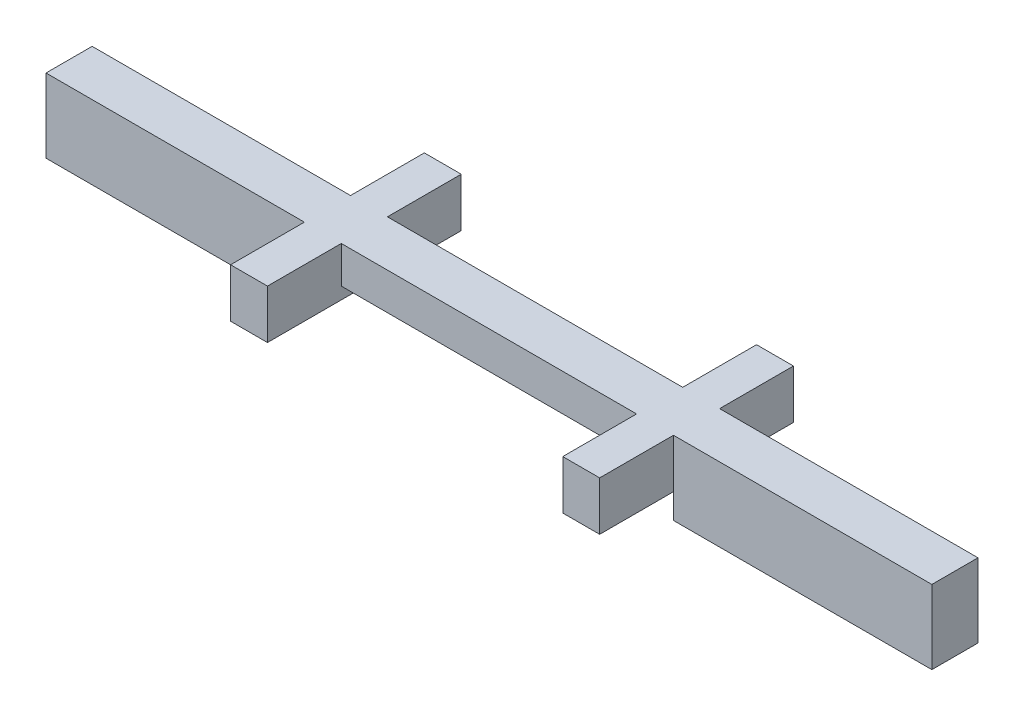
ISO-10303-21;
HEADER;
FILE_DESCRIPTION(('STEP AP214'),'2;1');
FILE_NAME('part.step','',(''),(''),'','','');
FILE_SCHEMA(('AUTOMOTIVE_DESIGN { 1 0 10303 214 1 1 1 1 }'));
ENDSEC;
DATA;
#1=APPLICATION_CONTEXT('core data for automotive mechanical design processes');
#2=APPLICATION_PROTOCOL_DEFINITION('international standard','automotive_design',2000,#1);
#3=PRODUCT_CONTEXT('',#1,'mechanical');
#4=PRODUCT('Part','Part','',(#3));
#5=PRODUCT_RELATED_PRODUCT_CATEGORY('part','',(#4));
#6=PRODUCT_DEFINITION_FORMATION('','',#4);
#7=PRODUCT_DEFINITION_CONTEXT('part definition',#1,'design');
#8=PRODUCT_DEFINITION('design','',#6,#7);
#9=PRODUCT_DEFINITION_SHAPE('','',#8);
#10=(LENGTH_UNIT() NAMED_UNIT(*) SI_UNIT(.MILLI.,.METRE.));
#11=(NAMED_UNIT(*) PLANE_ANGLE_UNIT() SI_UNIT($,.RADIAN.));
#12=(NAMED_UNIT(*) SI_UNIT($,.STERADIAN.) SOLID_ANGLE_UNIT());
#13=UNCERTAINTY_MEASURE_WITH_UNIT(LENGTH_MEASURE(1.E-05),#10,'distance_accuracy_value','');
#14=(GEOMETRIC_REPRESENTATION_CONTEXT(3) GLOBAL_UNCERTAINTY_ASSIGNED_CONTEXT((#13)) GLOBAL_UNIT_ASSIGNED_CONTEXT((#10,
#11,#12)) REPRESENTATION_CONTEXT('',''));
#15=CARTESIAN_POINT('',(0.,0.,0.));
#16=DIRECTION('',(0.,0.,1.));
#17=DIRECTION('',(1.,0.,0.));
#18=AXIS2_PLACEMENT_3D('',#15,#16,#17);
#19=CARTESIAN_POINT('',(0.,0.,1.25));
#20=DIRECTION('',(0.,0.,-1.));
#21=DIRECTION('',(-1.,0.,0.));
#22=AXIS2_PLACEMENT_3D('',#19,#20,#21);
#23=PLANE('',#22);
#24=DIRECTION('',(0.,-1.,0.));
#25=VECTOR('',#24,1.);
#26=CARTESIAN_POINT('',(9.,-0.325,1.25));
#27=LINE('',#26,#25);
#28=CARTESIAN_POINT('',(9.,1.,1.25));
#29=VERTEX_POINT('',#28);
#30=CARTESIAN_POINT('',(9.,0.,1.25));
#31=VERTEX_POINT('',#30);
#32=EDGE_CURVE('E57',#29,#31,#27,.T.);
#33=ORIENTED_EDGE('',*,*,#32,.F.);
#34=DIRECTION('',(-1.,0.,0.));
#35=VECTOR('',#34,1.);
#36=CARTESIAN_POINT('',(10.,1.,1.25));
#37=LINE('',#36,#35);
#38=CARTESIAN_POINT('',(0.999999999999999,1.,1.25));
#39=VERTEX_POINT('',#38);
#40=EDGE_CURVE('E338',#29,#39,#37,.T.);
#41=ORIENTED_EDGE('',*,*,#40,.T.);
#42=DIRECTION('',(0.,1.,0.));
#43=VECTOR('',#42,1.);
#44=CARTESIAN_POINT('',(1.,-0.325,1.25));
#45=LINE('',#44,#43);
#46=CARTESIAN_POINT('',(1.,0.,1.25));
#47=VERTEX_POINT('',#46);
#48=EDGE_CURVE('E11',#47,#39,#45,.T.);
#49=ORIENTED_EDGE('',*,*,#48,.F.);
#50=DIRECTION('',(1.,0.,0.));
#51=VECTOR('',#50,1.);
#52=CARTESIAN_POINT('',(1.,0.,1.25));
#53=LINE('',#52,#51);
#54=EDGE_CURVE('E349',#47,#31,#53,.T.);
#55=ORIENTED_EDGE('',*,*,#54,.T.);
#56=EDGE_LOOP('',(#33,#41,#49,#55));
#57=FACE_BOUND('',#56,.T.);
#58=ADVANCED_FACE('F39',(#57),#23,.F.);
#59=DIRECTION('',(0.,1.,0.));
#60=VECTOR('',#59,1.);
#61=CARTESIAN_POINT('',(10.,-0.325,1.25));
#62=LINE('',#61,#60);
#63=CARTESIAN_POINT('',(10.,-0.325,1.25));
#64=VERTEX_POINT('',#63);
#65=CARTESIAN_POINT('',(10.,1.,1.25));
#66=VERTEX_POINT('',#65);
#67=EDGE_CURVE('E225',#64,#66,#62,.T.);
#68=ORIENTED_EDGE('',*,*,#67,.F.);
#69=DIRECTION('',(0.,-1.,0.));
#70=VECTOR('',#69,1.);
#71=CARTESIAN_POINT('',(10.,-0.325,1.25));
#72=LINE('',#71,#70);
#73=CARTESIAN_POINT('',(10.,-1.,1.25));
#74=VERTEX_POINT('',#73);
#75=EDGE_CURVE('E352',#64,#74,#72,.T.);
#76=ORIENTED_EDGE('',*,*,#75,.T.);
#77=DIRECTION('',(1.,0.,0.));
#78=VECTOR('',#77,1.);
#79=CARTESIAN_POINT('',(10.,-1.,1.25));
#80=LINE('',#79,#78);
#81=CARTESIAN_POINT('',(17.,-1.,1.25));
#82=VERTEX_POINT('',#81);
#83=EDGE_CURVE('E355',#74,#82,#80,.T.);
#84=ORIENTED_EDGE('',*,*,#83,.T.);
#85=DIRECTION('',(0.,1.,0.));
#86=VECTOR('',#85,1.);
#87=CARTESIAN_POINT('',(17.,1.,1.25));
#88=LINE('',#87,#86);
#89=CARTESIAN_POINT('',(17.,1.,1.25));
#90=VERTEX_POINT('',#89);
#91=EDGE_CURVE('E358',#82,#90,#88,.T.);
#92=ORIENTED_EDGE('',*,*,#91,.T.);
#93=EDGE_CURVE('E65',#90,#66,#37,.T.);
#94=ORIENTED_EDGE('',*,*,#93,.T.);
#95=EDGE_LOOP('',(#68,#76,#84,#92,#94));
#96=FACE_BOUND('',#95,.T.);
#97=ADVANCED_FACE('F478',(#96),#23,.F.);
#98=DIRECTION('',(0.,-1.,0.));
#99=VECTOR('',#98,1.);
#100=CARTESIAN_POINT('',(0.,-0.325,1.25));
#101=LINE('',#100,#99);
#102=CARTESIAN_POINT('',(0.,1.,1.25));
#103=VERTEX_POINT('',#102);
#104=CARTESIAN_POINT('',(0.,-0.325,1.25));
#105=VERTEX_POINT('',#104);
#106=EDGE_CURVE('E245',#103,#105,#101,.T.);
#107=ORIENTED_EDGE('',*,*,#106,.F.);
#108=CARTESIAN_POINT('',(-7.,0.999999999999999,1.25));
#109=VERTEX_POINT('',#108);
#110=EDGE_CURVE('E339',#103,#109,#37,.T.);
#111=ORIENTED_EDGE('',*,*,#110,.T.);
#112=DIRECTION('',(0.,-1.,0.));
#113=VECTOR('',#112,1.);
#114=CARTESIAN_POINT('',(-7.,0.999999999999999,1.25));
#115=LINE('',#114,#113);
#116=CARTESIAN_POINT('',(-7.,-1.,1.25));
#117=VERTEX_POINT('',#116);
#118=EDGE_CURVE('E337',#109,#117,#115,.T.);
#119=ORIENTED_EDGE('',*,*,#118,.T.);
#120=DIRECTION('',(1.,0.,0.));
#121=VECTOR('',#120,1.);
#122=CARTESIAN_POINT('',(0.,-1.,1.25));
#123=LINE('',#122,#121);
#124=CARTESIAN_POINT('',(0.,-1.,1.25));
#125=VERTEX_POINT('',#124);
#126=EDGE_CURVE('E342',#117,#125,#123,.T.);
#127=ORIENTED_EDGE('',*,*,#126,.T.);
#128=DIRECTION('',(0.,1.,0.));
#129=VECTOR('',#128,1.);
#130=CARTESIAN_POINT('',(0.,-0.325,1.25));
#131=LINE('',#130,#129);
#132=EDGE_CURVE('E345',#125,#105,#131,.T.);
#133=ORIENTED_EDGE('',*,*,#132,.T.);
#134=EDGE_LOOP('',(#107,#111,#119,#127,#133));
#135=FACE_BOUND('',#134,.T.);
#136=ADVANCED_FACE('F448',(#135),#23,.F.);
#137=CARTESIAN_POINT('',(0.,0.,0.));
#138=DIRECTION('',(0.,0.,-1.));
#139=DIRECTION('',(-1.,0.,0.));
#140=AXIS2_PLACEMENT_3D('',#137,#138,#139);
#141=PLANE('',#140);
#142=DIRECTION('',(1.,0.,0.));
#143=VECTOR('',#142,1.);
#144=CARTESIAN_POINT('',(1.,0.,0.));
#145=LINE('',#144,#143);
#146=CARTESIAN_POINT('',(1.,0.,0.));
#147=VERTEX_POINT('',#146);
#148=CARTESIAN_POINT('',(9.,0.,0.));
#149=VERTEX_POINT('',#148);
#150=EDGE_CURVE('E377',#147,#149,#145,.T.);
#151=ORIENTED_EDGE('',*,*,#150,.F.);
#152=DIRECTION('',(0.,-1.,0.));
#153=VECTOR('',#152,1.);
#154=CARTESIAN_POINT('',(1.,-0.325,0.));
#155=LINE('',#154,#153);
#156=CARTESIAN_POINT('',(1.,0.999999999999999,0.));
#157=VERTEX_POINT('',#156);
#158=EDGE_CURVE('E275',#157,#147,#155,.T.);
#159=ORIENTED_EDGE('',*,*,#158,.F.);
#160=DIRECTION('',(-1.,0.,0.));
#161=VECTOR('',#160,1.);
#162=CARTESIAN_POINT('',(0.,1.,0.));
#163=LINE('',#162,#161);
#164=CARTESIAN_POINT('',(9.,1.,0.));
#165=VERTEX_POINT('',#164);
#166=EDGE_CURVE('E367',#165,#157,#163,.T.);
#167=ORIENTED_EDGE('',*,*,#166,.F.);
#168=DIRECTION('',(0.,1.,0.));
#169=VECTOR('',#168,1.);
#170=CARTESIAN_POINT('',(9.,-0.325,0.));
#171=LINE('',#170,#169);
#172=EDGE_CURVE('E49',#149,#165,#171,.T.);
#173=ORIENTED_EDGE('',*,*,#172,.F.);
#174=EDGE_LOOP('',(#151,#159,#167,#173));
#175=FACE_BOUND('',#174,.T.);
#176=ADVANCED_FACE('F503',(#175),#141,.T.);
#177=CARTESIAN_POINT('',(0.,0.999999999999999,0.));
#178=VERTEX_POINT('',#177);
#179=CARTESIAN_POINT('',(-7.,0.999999999999999,0.));
#180=VERTEX_POINT('',#179);
#181=EDGE_CURVE('E334',#178,#180,#163,.T.);
#182=ORIENTED_EDGE('',*,*,#181,.F.);
#183=DIRECTION('',(0.,1.,0.));
#184=VECTOR('',#183,1.);
#185=CARTESIAN_POINT('',(0.,-0.325,0.));
#186=LINE('',#185,#184);
#187=CARTESIAN_POINT('',(0.,-0.325,0.));
#188=VERTEX_POINT('',#187);
#189=EDGE_CURVE('E281',#188,#178,#186,.T.);
#190=ORIENTED_EDGE('',*,*,#189,.F.);
#191=DIRECTION('',(0.,1.,0.));
#192=VECTOR('',#191,1.);
#193=CARTESIAN_POINT('',(0.,-0.325,0.));
#194=LINE('',#193,#192);
#195=CARTESIAN_POINT('',(0.,-1.,0.));
#196=VERTEX_POINT('',#195);
#197=EDGE_CURVE('E373',#196,#188,#194,.T.);
#198=ORIENTED_EDGE('',*,*,#197,.F.);
#199=DIRECTION('',(1.,0.,0.));
#200=VECTOR('',#199,1.);
#201=CARTESIAN_POINT('',(0.,-1.,0.));
#202=LINE('',#201,#200);
#203=CARTESIAN_POINT('',(-7.,-1.,0.));
#204=VERTEX_POINT('',#203);
#205=EDGE_CURVE('E370',#204,#196,#202,.T.);
#206=ORIENTED_EDGE('',*,*,#205,.F.);
#207=DIRECTION('',(0.,-1.,0.));
#208=VECTOR('',#207,1.);
#209=CARTESIAN_POINT('',(-7.,0.999999999999999,0.));
#210=LINE('',#209,#208);
#211=EDGE_CURVE('E366',#180,#204,#210,.T.);
#212=ORIENTED_EDGE('',*,*,#211,.F.);
#213=EDGE_LOOP('',(#182,#190,#198,#206,#212));
#214=FACE_BOUND('',#213,.T.);
#215=ADVANCED_FACE('F439',(#214),#141,.T.);
#216=CARTESIAN_POINT('',(0.,1.,1.25));
#217=DIRECTION('',(0.,-1.,0.));
#218=DIRECTION('',(1.,0.,0.));
#219=AXIS2_PLACEMENT_3D('',#216,#217,#218);
#220=PLANE('',#219);
#221=CARTESIAN_POINT('',(17.,1.,0.));
#222=VERTEX_POINT('',#221);
#223=CARTESIAN_POINT('',(10.,1.,0.));
#224=VERTEX_POINT('',#223);
#225=EDGE_CURVE('E362',#222,#224,#163,.T.);
#226=ORIENTED_EDGE('',*,*,#225,.T.);
#227=DIRECTION('',(0.,0.,1.));
#228=VECTOR('',#227,1.);
#229=CARTESIAN_POINT('',(10.,1.,-2.));
#230=LINE('',#229,#228);
#231=CARTESIAN_POINT('',(10.,1.,-2.));
#232=VERTEX_POINT('',#231);
#233=EDGE_CURVE('E326',#232,#224,#230,.T.);
#234=ORIENTED_EDGE('',*,*,#233,.F.);
#235=DIRECTION('',(1.,0.,0.));
#236=VECTOR('',#235,1.);
#237=CARTESIAN_POINT('',(9.,1.,-2.));
#238=LINE('',#237,#236);
#239=CARTESIAN_POINT('',(9.,1.,-2.));
#240=VERTEX_POINT('',#239);
#241=EDGE_CURVE('E307',#240,#232,#238,.T.);
#242=ORIENTED_EDGE('',*,*,#241,.F.);
#243=DIRECTION('',(0.,0.,1.));
#244=VECTOR('',#243,1.);
#245=CARTESIAN_POINT('',(9.,1.,-2.));
#246=LINE('',#245,#244);
#247=EDGE_CURVE('E330',#240,#165,#246,.T.);
#248=ORIENTED_EDGE('',*,*,#247,.T.);
#249=ORIENTED_EDGE('',*,*,#166,.T.);
#250=DIRECTION('',(0.,0.,1.));
#251=VECTOR('',#250,1.);
#252=CARTESIAN_POINT('',(1.,0.999999999999999,-2.));
#253=LINE('',#252,#251);
#254=CARTESIAN_POINT('',(1.,0.999999999999999,-2.));
#255=VERTEX_POINT('',#254);
#256=EDGE_CURVE('E290',#255,#157,#253,.T.);
#257=ORIENTED_EDGE('',*,*,#256,.F.);
#258=DIRECTION('',(1.,0.,0.));
#259=VECTOR('',#258,1.);
#260=CARTESIAN_POINT('',(1.,0.999999999999999,-2.));
#261=LINE('',#260,#259);
#262=CARTESIAN_POINT('',(0.,0.999999999999999,-2.));
#263=VERTEX_POINT('',#262);
#264=EDGE_CURVE('E287',#263,#255,#261,.T.);
#265=ORIENTED_EDGE('',*,*,#264,.F.);
#266=DIRECTION('',(0.,0.,1.));
#267=VECTOR('',#266,1.);
#268=CARTESIAN_POINT('',(0.,0.999999999999999,-2.));
#269=LINE('',#268,#267);
#270=EDGE_CURVE('E297',#263,#178,#269,.T.);
#271=ORIENTED_EDGE('',*,*,#270,.T.);
#272=ORIENTED_EDGE('',*,*,#181,.T.);
#273=DIRECTION('',(0.,0.,-1.));
#274=VECTOR('',#273,1.);
#275=CARTESIAN_POINT('',(-7.,0.999999999999999,1.25));
#276=LINE('',#275,#274);
#277=EDGE_CURVE('E43',#109,#180,#276,.T.);
#278=ORIENTED_EDGE('',*,*,#277,.F.);
#279=ORIENTED_EDGE('',*,*,#110,.F.);
#280=DIRECTION('',(0.,0.,-1.));
#281=VECTOR('',#280,1.);
#282=CARTESIAN_POINT('',(0.,1.,3.25));
#283=LINE('',#282,#281);
#284=CARTESIAN_POINT('',(0.,1.,3.25));
#285=VERTEX_POINT('',#284);
#286=EDGE_CURVE('E267',#285,#103,#283,.T.);
#287=ORIENTED_EDGE('',*,*,#286,.F.);
#288=DIRECTION('',(-1.,0.,0.));
#289=VECTOR('',#288,1.);
#290=CARTESIAN_POINT('',(1.,0.999999999999999,3.25));
#291=LINE('',#290,#289);
#292=CARTESIAN_POINT('',(1.,0.999999999999999,3.25));
#293=VERTEX_POINT('',#292);
#294=EDGE_CURVE('E250',#293,#285,#291,.T.);
#295=ORIENTED_EDGE('',*,*,#294,.F.);
#296=DIRECTION('',(0.,0.,-1.));
#297=VECTOR('',#296,1.);
#298=CARTESIAN_POINT('',(1.,0.999999999999999,3.25));
#299=LINE('',#298,#297);
#300=EDGE_CURVE('E271',#293,#39,#299,.T.);
#301=ORIENTED_EDGE('',*,*,#300,.T.);
#302=ORIENTED_EDGE('',*,*,#40,.F.);
#303=DIRECTION('',(0.,0.,-1.));
#304=VECTOR('',#303,1.);
#305=CARTESIAN_POINT('',(9.,1.,3.25));
#306=LINE('',#305,#304);
#307=CARTESIAN_POINT('',(9.,1.,3.25));
#308=VERTEX_POINT('',#307);
#309=EDGE_CURVE('E234',#308,#29,#306,.T.);
#310=ORIENTED_EDGE('',*,*,#309,.F.);
#311=DIRECTION('',(-1.,0.,0.));
#312=VECTOR('',#311,1.);
#313=CARTESIAN_POINT('',(9.,1.,3.25));
#314=LINE('',#313,#312);
#315=CARTESIAN_POINT('',(10.,1.,3.25));
#316=VERTEX_POINT('',#315);
#317=EDGE_CURVE('E222',#316,#308,#314,.T.);
#318=ORIENTED_EDGE('',*,*,#317,.F.);
#319=DIRECTION('',(0.,0.,-1.));
#320=VECTOR('',#319,1.);
#321=CARTESIAN_POINT('',(10.,1.,3.25));
#322=LINE('',#321,#320);
#323=EDGE_CURVE('E239',#316,#66,#322,.T.);
#324=ORIENTED_EDGE('',*,*,#323,.T.);
#325=ORIENTED_EDGE('',*,*,#93,.F.);
#326=DIRECTION('',(0.,0.,-1.));
#327=VECTOR('',#326,1.);
#328=CARTESIAN_POINT('',(17.,1.,1.25));
#329=LINE('',#328,#327);
#330=EDGE_CURVE('E361',#90,#222,#329,.T.);
#331=ORIENTED_EDGE('',*,*,#330,.T.);
#332=EDGE_LOOP('',(#226,#234,#242,#248,#249,#257,#265,#271,#272,#278,#279,#287,#295,#301,#302,
#310,#318,#324,#325,#331));
#333=FACE_BOUND('',#332,.T.);
#334=ADVANCED_FACE('F41',(#333),#220,.F.);
#335=CARTESIAN_POINT('',(-7.,0.999999999999999,1.25));
#336=DIRECTION('',(1.,0.,0.));
#337=DIRECTION('',(0.,1.,0.));
#338=AXIS2_PLACEMENT_3D('',#335,#336,#337);
#339=PLANE('',#338);
#340=ORIENTED_EDGE('',*,*,#211,.T.);
#341=DIRECTION('',(0.,0.,-1.));
#342=VECTOR('',#341,1.);
#343=CARTESIAN_POINT('',(-7.,-1.,1.25));
#344=LINE('',#343,#342);
#345=EDGE_CURVE('E421',#117,#204,#344,.T.);
#346=ORIENTED_EDGE('',*,*,#345,.F.);
#347=ORIENTED_EDGE('',*,*,#118,.F.);
#348=ORIENTED_EDGE('',*,*,#277,.T.);
#349=EDGE_LOOP('',(#340,#346,#347,#348));
#350=FACE_BOUND('',#349,.T.);
#351=ADVANCED_FACE('F434',(#350),#339,.F.);
#352=CARTESIAN_POINT('',(0.,-1.,1.25));
#353=DIRECTION('',(0.,1.,0.));
#354=DIRECTION('',(-1.,0.,0.));
#355=AXIS2_PLACEMENT_3D('',#352,#353,#354);
#356=PLANE('',#355);
#357=ORIENTED_EDGE('',*,*,#205,.T.);
#358=DIRECTION('',(0.,0.,-1.));
#359=VECTOR('',#358,1.);
#360=CARTESIAN_POINT('',(0.,-1.,1.25));
#361=LINE('',#360,#359);
#362=EDGE_CURVE('E418',#125,#196,#361,.T.);
#363=ORIENTED_EDGE('',*,*,#362,.F.);
#364=ORIENTED_EDGE('',*,*,#126,.F.);
#365=ORIENTED_EDGE('',*,*,#345,.T.);
#366=EDGE_LOOP('',(#357,#363,#364,#365));
#367=FACE_BOUND('',#366,.T.);
#368=ADVANCED_FACE('F443',(#367),#356,.F.);
#369=CARTESIAN_POINT('',(0.,-0.325,1.25));
#370=DIRECTION('',(-1.,0.,0.));
#371=DIRECTION('',(0.,-1.,0.));
#372=AXIS2_PLACEMENT_3D('',#369,#370,#371);
#373=PLANE('',#372);
#374=ORIENTED_EDGE('',*,*,#197,.T.);
#375=DIRECTION('',(0.,0.,-1.));
#376=VECTOR('',#375,1.);
#377=CARTESIAN_POINT('',(0.,-0.325,1.25));
#378=LINE('',#377,#376);
#379=EDGE_CURVE('E414',#105,#188,#378,.T.);
#380=ORIENTED_EDGE('',*,*,#379,.F.);
#381=ORIENTED_EDGE('',*,*,#132,.F.);
#382=ORIENTED_EDGE('',*,*,#362,.T.);
#383=EDGE_LOOP('',(#374,#380,#381,#382));
#384=FACE_BOUND('',#383,.T.);
#385=ADVANCED_FACE('F446',(#384),#373,.F.);
#386=CARTESIAN_POINT('',(0.,-0.325,1.25));
#387=DIRECTION('',(0.,1.,0.));
#388=DIRECTION('',(0.,0.,1.));
#389=AXIS2_PLACEMENT_3D('',#386,#387,#388);
#390=PLANE('',#389);
#391=ORIENTED_EDGE('',*,*,#379,.T.);
#392=DIRECTION('',(0.,0.,1.));
#393=VECTOR('',#392,1.);
#394=CARTESIAN_POINT('',(0.,-0.325,-2.));
#395=LINE('',#394,#393);
#396=CARTESIAN_POINT('',(0.,-0.325,-2.));
#397=VERTEX_POINT('',#396);
#398=EDGE_CURVE('E301',#397,#188,#395,.T.);
#399=ORIENTED_EDGE('',*,*,#398,.F.);
#400=DIRECTION('',(-1.,0.,0.));
#401=VECTOR('',#400,1.);
#402=CARTESIAN_POINT('',(1.,-0.325,-2.));
#403=LINE('',#402,#401);
#404=CARTESIAN_POINT('',(1.,-0.325,-2.));
#405=VERTEX_POINT('',#404);
#406=EDGE_CURVE('E280',#405,#397,#403,.T.);
#407=ORIENTED_EDGE('',*,*,#406,.F.);
#408=DIRECTION('',(0.,0.,-1.));
#409=VECTOR('',#408,1.);
#410=CARTESIAN_POINT('',(1.,-0.325,1.25));
#411=LINE('',#410,#409);
#412=CARTESIAN_POINT('',(1.,-0.325,3.25));
#413=VERTEX_POINT('',#412);
#414=EDGE_CURVE('E411',#413,#405,#411,.T.);
#415=ORIENTED_EDGE('',*,*,#414,.F.);
#416=DIRECTION('',(1.,0.,0.));
#417=VECTOR('',#416,1.);
#418=CARTESIAN_POINT('',(1.,-0.325,3.25));
#419=LINE('',#418,#417);
#420=CARTESIAN_POINT('',(0.,-0.325,3.25));
#421=VERTEX_POINT('',#420);
#422=EDGE_CURVE('E256',#421,#413,#419,.T.);
#423=ORIENTED_EDGE('',*,*,#422,.F.);
#424=DIRECTION('',(0.,0.,-1.));
#425=VECTOR('',#424,1.);
#426=CARTESIAN_POINT('',(0.,-0.325,3.25));
#427=LINE('',#426,#425);
#428=EDGE_CURVE('E259',#421,#105,#427,.T.);
#429=ORIENTED_EDGE('',*,*,#428,.T.);
#430=EDGE_LOOP('',(#391,#399,#407,#415,#423,#429));
#431=FACE_BOUND('',#430,.T.);
#432=ADVANCED_FACE('F456',(#431),#390,.F.);
#433=CARTESIAN_POINT('',(1.,0.,1.25));
#434=DIRECTION('',(-1.,0.,0.));
#435=DIRECTION('',(0.,0.,1.));
#436=AXIS2_PLACEMENT_3D('',#433,#434,#435);
#437=PLANE('',#436);
#438=ORIENTED_EDGE('',*,*,#414,.T.);
#439=DIRECTION('',(0.,-1.,0.));
#440=VECTOR('',#439,1.);
#441=CARTESIAN_POINT('',(1.,-0.325,-2.));
#442=LINE('',#441,#440);
#443=EDGE_CURVE('E276',#255,#405,#442,.T.);
#444=ORIENTED_EDGE('',*,*,#443,.F.);
#445=ORIENTED_EDGE('',*,*,#256,.T.);
#446=ORIENTED_EDGE('',*,*,#158,.T.);
#447=DIRECTION('',(0.,0.,-1.));
#448=VECTOR('',#447,1.);
#449=CARTESIAN_POINT('',(1.,0.,1.25));
#450=LINE('',#449,#448);
#451=EDGE_CURVE('E407',#47,#147,#450,.T.);
#452=ORIENTED_EDGE('',*,*,#451,.F.);
#453=ORIENTED_EDGE('',*,*,#48,.T.);
#454=ORIENTED_EDGE('',*,*,#300,.F.);
#455=DIRECTION('',(0.,1.,0.));
#456=VECTOR('',#455,1.);
#457=CARTESIAN_POINT('',(1.,-0.325,3.25));
#458=LINE('',#457,#456);
#459=EDGE_CURVE('E246',#413,#293,#458,.T.);
#460=ORIENTED_EDGE('',*,*,#459,.F.);
#461=EDGE_LOOP('',(#438,#444,#445,#446,#452,#453,#454,#460));
#462=FACE_BOUND('',#461,.T.);
#463=ADVANCED_FACE('F464',(#462),#437,.F.);
#464=CARTESIAN_POINT('',(1.,0.,1.25));
#465=DIRECTION('',(0.,1.,0.));
#466=DIRECTION('',(-1.,0.,0.));
#467=AXIS2_PLACEMENT_3D('',#464,#465,#466);
#468=PLANE('',#467);
#469=ORIENTED_EDGE('',*,*,#150,.T.);
#470=DIRECTION('',(0.,0.,-1.));
#471=VECTOR('',#470,1.);
#472=CARTESIAN_POINT('',(9.,0.,1.25));
#473=LINE('',#472,#471);
#474=EDGE_CURVE('E206',#31,#149,#473,.T.);
#475=ORIENTED_EDGE('',*,*,#474,.F.);
#476=ORIENTED_EDGE('',*,*,#54,.F.);
#477=ORIENTED_EDGE('',*,*,#451,.T.);
#478=EDGE_LOOP('',(#469,#475,#476,#477));
#479=FACE_BOUND('',#478,.T.);
#480=ADVANCED_FACE('F474',(#479),#468,.F.);
#481=CARTESIAN_POINT('',(9.,0.,1.25));
#482=DIRECTION('',(1.,0.,0.));
#483=DIRECTION('',(0.,0.,-1.));
#484=AXIS2_PLACEMENT_3D('',#481,#482,#483);
#485=PLANE('',#484);
#486=ORIENTED_EDGE('',*,*,#474,.T.);
#487=ORIENTED_EDGE('',*,*,#172,.T.);
#488=ORIENTED_EDGE('',*,*,#247,.F.);
#489=DIRECTION('',(0.,1.,0.));
#490=VECTOR('',#489,1.);
#491=CARTESIAN_POINT('',(9.,-0.325,-2.));
#492=LINE('',#491,#490);
#493=CARTESIAN_POINT('',(9.,-0.325,-2.));
#494=VERTEX_POINT('',#493);
#495=EDGE_CURVE('E201',#494,#240,#492,.T.);
#496=ORIENTED_EDGE('',*,*,#495,.F.);
#497=DIRECTION('',(0.,0.,-1.));
#498=VECTOR('',#497,1.);
#499=CARTESIAN_POINT('',(9.,-0.325,1.25));
#500=LINE('',#499,#498);
#501=CARTESIAN_POINT('',(9.,-0.325,3.25));
#502=VERTEX_POINT('',#501);
#503=EDGE_CURVE('E192',#502,#494,#500,.T.);
#504=ORIENTED_EDGE('',*,*,#503,.F.);
#505=DIRECTION('',(0.,-1.,0.));
#506=VECTOR('',#505,1.);
#507=CARTESIAN_POINT('',(9.,-0.325,3.25));
#508=LINE('',#507,#506);
#509=EDGE_CURVE('E198',#308,#502,#508,.T.);
#510=ORIENTED_EDGE('',*,*,#509,.F.);
#511=ORIENTED_EDGE('',*,*,#309,.T.);
#512=ORIENTED_EDGE('',*,*,#32,.T.);
#513=EDGE_LOOP('',(#486,#487,#488,#496,#504,#510,#511,#512));
#514=FACE_BOUND('',#513,.T.);
#515=ADVANCED_FACE('F195',(#514),#485,.F.);
#516=CARTESIAN_POINT('',(10.,-0.325,1.25));
#517=DIRECTION('',(0.,1.,0.));
#518=DIRECTION('',(-1.,0.,0.));
#519=AXIS2_PLACEMENT_3D('',#516,#517,#518);
#520=PLANE('',#519);
#521=ORIENTED_EDGE('',*,*,#503,.T.);
#522=DIRECTION('',(-1.,0.,0.));
#523=VECTOR('',#522,1.);
#524=CARTESIAN_POINT('',(9.,-0.325,-2.));
#525=LINE('',#524,#523);
#526=CARTESIAN_POINT('',(10.,-0.325,-2.));
#527=VERTEX_POINT('',#526);
#528=EDGE_CURVE('E313',#527,#494,#525,.T.);
#529=ORIENTED_EDGE('',*,*,#528,.F.);
#530=DIRECTION('',(0.,0.,1.));
#531=VECTOR('',#530,1.);
#532=CARTESIAN_POINT('',(10.,-0.325,-2.));
#533=LINE('',#532,#531);
#534=CARTESIAN_POINT('',(10.,-0.325,0.));
#535=VERTEX_POINT('',#534);
#536=EDGE_CURVE('E316',#527,#535,#533,.T.);
#537=ORIENTED_EDGE('',*,*,#536,.T.);
#538=DIRECTION('',(0.,0.,-1.));
#539=VECTOR('',#538,1.);
#540=CARTESIAN_POINT('',(10.,-0.325,1.25));
#541=LINE('',#540,#539);
#542=EDGE_CURVE('E207',#64,#535,#541,.T.);
#543=ORIENTED_EDGE('',*,*,#542,.F.);
#544=DIRECTION('',(0.,0.,-1.));
#545=VECTOR('',#544,1.);
#546=CARTESIAN_POINT('',(10.,-0.325,3.25));
#547=LINE('',#546,#545);
#548=CARTESIAN_POINT('',(10.,-0.325,3.25));
#549=VERTEX_POINT('',#548);
#550=EDGE_CURVE('E214',#549,#64,#547,.T.);
#551=ORIENTED_EDGE('',*,*,#550,.F.);
#552=DIRECTION('',(1.,0.,0.));
#553=VECTOR('',#552,1.);
#554=CARTESIAN_POINT('',(9.,-0.325,3.25));
#555=LINE('',#554,#553);
#556=EDGE_CURVE('E210',#502,#549,#555,.T.);
#557=ORIENTED_EDGE('',*,*,#556,.F.);
#558=EDGE_LOOP('',(#521,#529,#537,#543,#551,#557));
#559=FACE_BOUND('',#558,.T.);
#560=ADVANCED_FACE('F211',(#559),#520,.F.);
#561=CARTESIAN_POINT('',(10.,-0.325,1.25));
#562=DIRECTION('',(1.,0.,0.));
#563=DIRECTION('',(0.,0.,-1.));
#564=AXIS2_PLACEMENT_3D('',#561,#562,#563);
#565=PLANE('',#564);
#566=DIRECTION('',(0.,-1.,0.));
#567=VECTOR('',#566,1.);
#568=CARTESIAN_POINT('',(10.,-0.325,0.));
#569=LINE('',#568,#567);
#570=CARTESIAN_POINT('',(10.,-1.,0.));
#571=VERTEX_POINT('',#570);
#572=EDGE_CURVE('E381',#535,#571,#569,.T.);
#573=ORIENTED_EDGE('',*,*,#572,.T.);
#574=DIRECTION('',(0.,0.,-1.));
#575=VECTOR('',#574,1.);
#576=CARTESIAN_POINT('',(10.,-1.,1.25));
#577=LINE('',#576,#575);
#578=EDGE_CURVE('E398',#74,#571,#577,.T.);
#579=ORIENTED_EDGE('',*,*,#578,.F.);
#580=ORIENTED_EDGE('',*,*,#75,.F.);
#581=ORIENTED_EDGE('',*,*,#542,.T.);
#582=EDGE_LOOP('',(#573,#579,#580,#581));
#583=FACE_BOUND('',#582,.T.);
#584=ADVANCED_FACE('F483',(#583),#565,.F.);
#585=CARTESIAN_POINT('',(10.,-1.,1.25));
#586=DIRECTION('',(0.,1.,0.));
#587=DIRECTION('',(0.,0.,1.));
#588=AXIS2_PLACEMENT_3D('',#585,#586,#587);
#589=PLANE('',#588);
#590=DIRECTION('',(1.,0.,0.));
#591=VECTOR('',#590,1.);
#592=CARTESIAN_POINT('',(10.,-1.,0.));
#593=LINE('',#592,#591);
#594=CARTESIAN_POINT('',(17.,-1.,0.));
#595=VERTEX_POINT('',#594);
#596=EDGE_CURVE('E384',#571,#595,#593,.T.);
#597=ORIENTED_EDGE('',*,*,#596,.T.);
#598=DIRECTION('',(0.,0.,-1.));
#599=VECTOR('',#598,1.);
#600=CARTESIAN_POINT('',(17.,-1.,1.25));
#601=LINE('',#600,#599);
#602=EDGE_CURVE('E394',#82,#595,#601,.T.);
#603=ORIENTED_EDGE('',*,*,#602,.F.);
#604=ORIENTED_EDGE('',*,*,#83,.F.);
#605=ORIENTED_EDGE('',*,*,#578,.T.);
#606=EDGE_LOOP('',(#597,#603,#604,#605));
#607=FACE_BOUND('',#606,.T.);
#608=ADVANCED_FACE('F486',(#607),#589,.F.);
#609=CARTESIAN_POINT('',(17.,1.,1.25));
#610=DIRECTION('',(-1.,0.,0.));
#611=DIRECTION('',(0.,0.,1.));
#612=AXIS2_PLACEMENT_3D('',#609,#610,#611);
#613=PLANE('',#612);
#614=DIRECTION('',(0.,1.,0.));
#615=VECTOR('',#614,1.);
#616=CARTESIAN_POINT('',(17.,1.,0.));
#617=LINE('',#616,#615);
#618=EDGE_CURVE('E387',#595,#222,#617,.T.);
#619=ORIENTED_EDGE('',*,*,#618,.T.);
#620=ORIENTED_EDGE('',*,*,#330,.F.);
#621=ORIENTED_EDGE('',*,*,#91,.F.);
#622=ORIENTED_EDGE('',*,*,#602,.T.);
#623=EDGE_LOOP('',(#619,#620,#621,#622));
#624=FACE_BOUND('',#623,.T.);
#625=ADVANCED_FACE('F491',(#624),#613,.F.);
#626=DIRECTION('',(0.,-1.,0.));
#627=VECTOR('',#626,1.);
#628=CARTESIAN_POINT('',(10.,-0.325,0.));
#629=LINE('',#628,#627);
#630=EDGE_CURVE('E304',#224,#535,#629,.T.);
#631=ORIENTED_EDGE('',*,*,#630,.F.);
#632=ORIENTED_EDGE('',*,*,#225,.F.);
#633=ORIENTED_EDGE('',*,*,#618,.F.);
#634=ORIENTED_EDGE('',*,*,#596,.F.);
#635=ORIENTED_EDGE('',*,*,#572,.F.);
#636=EDGE_LOOP('',(#631,#632,#633,#634,#635));
#637=FACE_BOUND('',#636,.T.);
#638=ADVANCED_FACE('F532',(#637),#141,.T.);
#639=CARTESIAN_POINT('',(10.,-0.325,-2.));
#640=DIRECTION('',(-1.,0.,0.));
#641=DIRECTION('',(0.,0.,1.));
#642=AXIS2_PLACEMENT_3D('',#639,#640,#641);
#643=PLANE('',#642);
#644=ORIENTED_EDGE('',*,*,#630,.T.);
#645=ORIENTED_EDGE('',*,*,#536,.F.);
#646=DIRECTION('',(0.,-1.,0.));
#647=VECTOR('',#646,1.);
#648=CARTESIAN_POINT('',(10.,-0.325,-2.));
#649=LINE('',#648,#647);
#650=EDGE_CURVE('E310',#232,#527,#649,.T.);
#651=ORIENTED_EDGE('',*,*,#650,.F.);
#652=ORIENTED_EDGE('',*,*,#233,.T.);
#653=EDGE_LOOP('',(#644,#645,#651,#652));
#654=FACE_BOUND('',#653,.T.);
#655=ADVANCED_FACE('F496',(#654),#643,.F.);
#656=CARTESIAN_POINT('',(0.,0.,-2.));
#657=DIRECTION('',(0.,0.,-1.));
#658=DIRECTION('',(-1.,0.,0.));
#659=AXIS2_PLACEMENT_3D('',#656,#657,#658);
#660=PLANE('',#659);
#661=ORIENTED_EDGE('',*,*,#495,.T.);
#662=ORIENTED_EDGE('',*,*,#241,.T.);
#663=ORIENTED_EDGE('',*,*,#650,.T.);
#664=ORIENTED_EDGE('',*,*,#528,.T.);
#665=EDGE_LOOP('',(#661,#662,#663,#664));
#666=FACE_BOUND('',#665,.T.);
#667=ADVANCED_FACE('F499',(#666),#660,.T.);
#668=CARTESIAN_POINT('',(0.,-0.325,-2.));
#669=DIRECTION('',(1.,0.,0.));
#670=DIRECTION('',(0.,0.,-1.));
#671=AXIS2_PLACEMENT_3D('',#668,#669,#670);
#672=PLANE('',#671);
#673=ORIENTED_EDGE('',*,*,#189,.T.);
#674=ORIENTED_EDGE('',*,*,#270,.F.);
#675=DIRECTION('',(0.,1.,0.));
#676=VECTOR('',#675,1.);
#677=CARTESIAN_POINT('',(0.,-0.325,-2.));
#678=LINE('',#677,#676);
#679=EDGE_CURVE('E284',#397,#263,#678,.T.);
#680=ORIENTED_EDGE('',*,*,#679,.F.);
#681=ORIENTED_EDGE('',*,*,#398,.T.);
#682=EDGE_LOOP('',(#673,#674,#680,#681));
#683=FACE_BOUND('',#682,.T.);
#684=ADVANCED_FACE('F510',(#683),#672,.F.);
#685=CARTESIAN_POINT('',(0.,0.,-2.));
#686=DIRECTION('',(0.,0.,1.));
#687=DIRECTION('',(1.,0.,0.));
#688=AXIS2_PLACEMENT_3D('',#685,#686,#687);
#689=PLANE('',#688);
#690=ORIENTED_EDGE('',*,*,#443,.T.);
#691=ORIENTED_EDGE('',*,*,#406,.T.);
#692=ORIENTED_EDGE('',*,*,#679,.T.);
#693=ORIENTED_EDGE('',*,*,#264,.T.);
#694=EDGE_LOOP('',(#690,#691,#692,#693));
#695=FACE_BOUND('',#694,.T.);
#696=ADVANCED_FACE('F512',(#695),#689,.F.);
#697=CARTESIAN_POINT('',(0.,-0.325,3.25));
#698=DIRECTION('',(1.,0.,0.));
#699=DIRECTION('',(0.,0.,-1.));
#700=AXIS2_PLACEMENT_3D('',#697,#698,#699);
#701=PLANE('',#700);
#702=ORIENTED_EDGE('',*,*,#106,.T.);
#703=ORIENTED_EDGE('',*,*,#428,.F.);
#704=DIRECTION('',(0.,-1.,0.));
#705=VECTOR('',#704,1.);
#706=CARTESIAN_POINT('',(0.,-0.325,3.25));
#707=LINE('',#706,#705);
#708=EDGE_CURVE('E253',#285,#421,#707,.T.);
#709=ORIENTED_EDGE('',*,*,#708,.F.);
#710=ORIENTED_EDGE('',*,*,#286,.T.);
#711=EDGE_LOOP('',(#702,#703,#709,#710));
#712=FACE_BOUND('',#711,.T.);
#713=ADVANCED_FACE('F451',(#712),#701,.F.);
#714=CARTESIAN_POINT('',(0.,0.,3.25));
#715=DIRECTION('',(0.,0.,1.));
#716=DIRECTION('',(1.,0.,0.));
#717=AXIS2_PLACEMENT_3D('',#714,#715,#716);
#718=PLANE('',#717);
#719=ORIENTED_EDGE('',*,*,#459,.T.);
#720=ORIENTED_EDGE('',*,*,#294,.T.);
#721=ORIENTED_EDGE('',*,*,#708,.T.);
#722=ORIENTED_EDGE('',*,*,#422,.T.);
#723=EDGE_LOOP('',(#719,#720,#721,#722));
#724=FACE_BOUND('',#723,.T.);
#725=ADVANCED_FACE('F461',(#724),#718,.T.);
#726=CARTESIAN_POINT('',(10.,-0.325,3.25));
#727=DIRECTION('',(-1.,0.,0.));
#728=DIRECTION('',(0.,0.,1.));
#729=AXIS2_PLACEMENT_3D('',#726,#727,#728);
#730=PLANE('',#729);
#731=ORIENTED_EDGE('',*,*,#67,.T.);
#732=ORIENTED_EDGE('',*,*,#323,.F.);
#733=DIRECTION('',(0.,1.,0.));
#734=VECTOR('',#733,1.);
#735=CARTESIAN_POINT('',(10.,-0.325,3.25));
#736=LINE('',#735,#734);
#737=EDGE_CURVE('E218',#549,#316,#736,.T.);
#738=ORIENTED_EDGE('',*,*,#737,.F.);
#739=ORIENTED_EDGE('',*,*,#550,.T.);
#740=EDGE_LOOP('',(#731,#732,#738,#739));
#741=FACE_BOUND('',#740,.T.);
#742=ADVANCED_FACE('F477',(#741),#730,.F.);
#743=CARTESIAN_POINT('',(0.,0.,3.25));
#744=DIRECTION('',(0.,0.,-1.));
#745=DIRECTION('',(-1.,0.,0.));
#746=AXIS2_PLACEMENT_3D('',#743,#744,#745);
#747=PLANE('',#746);
#748=ORIENTED_EDGE('',*,*,#509,.T.);
#749=ORIENTED_EDGE('',*,*,#556,.T.);
#750=ORIENTED_EDGE('',*,*,#737,.T.);
#751=ORIENTED_EDGE('',*,*,#317,.T.);
#752=EDGE_LOOP('',(#748,#749,#750,#751));
#753=FACE_BOUND('',#752,.T.);
#754=ADVANCED_FACE('F220',(#753),#747,.F.);
#755=CLOSED_SHELL('',(#58,#97,#136,#176,#215,#334,#351,#368,#385,#432,#463,#480,#515,#560,#584,
#608,#625,#638,#655,#667,#684,#696,#713,#725,#742,#754));
#756=MANIFOLD_SOLID_BREP('B2',#755);
#757=ADVANCED_BREP_SHAPE_REPRESENTATION('',(#18,#756),#14);
#758=SHAPE_DEFINITION_REPRESENTATION(#9,#757);
ENDSEC;
END-ISO-10303-21;
